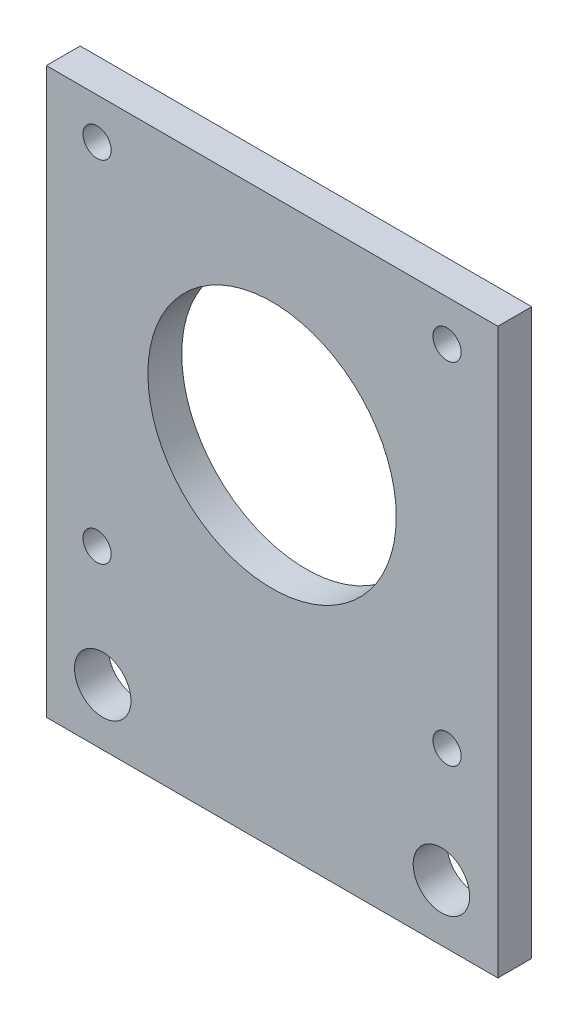
ISO-10303-21;
HEADER;
FILE_DESCRIPTION(('STEP AP214'),'2;1');
FILE_NAME('part.step','',(''),(''),'','','');
FILE_SCHEMA(('AUTOMOTIVE_DESIGN { 1 0 10303 214 1 1 1 1 }'));
ENDSEC;
DATA;
#1=APPLICATION_CONTEXT('core data for automotive mechanical design processes');
#2=APPLICATION_PROTOCOL_DEFINITION('international standard','automotive_design',2000,#1);
#3=PRODUCT_CONTEXT('',#1,'mechanical');
#4=PRODUCT('Part','Part','',(#3));
#5=PRODUCT_RELATED_PRODUCT_CATEGORY('part','',(#4));
#6=PRODUCT_DEFINITION_FORMATION('','',#4);
#7=PRODUCT_DEFINITION_CONTEXT('part definition',#1,'design');
#8=PRODUCT_DEFINITION('design','',#6,#7);
#9=PRODUCT_DEFINITION_SHAPE('','',#8);
#10=(LENGTH_UNIT() NAMED_UNIT(*) SI_UNIT(.MILLI.,.METRE.));
#11=(NAMED_UNIT(*) PLANE_ANGLE_UNIT() SI_UNIT($,.RADIAN.));
#12=(NAMED_UNIT(*) SI_UNIT($,.STERADIAN.) SOLID_ANGLE_UNIT());
#13=UNCERTAINTY_MEASURE_WITH_UNIT(LENGTH_MEASURE(1.E-05),#10,'distance_accuracy_value','');
#14=(GEOMETRIC_REPRESENTATION_CONTEXT(3) GLOBAL_UNCERTAINTY_ASSIGNED_CONTEXT((#13)) GLOBAL_UNIT_ASSIGNED_CONTEXT((#10,
#11,#12)) REPRESENTATION_CONTEXT('',''));
#15=CARTESIAN_POINT('',(0.,0.,0.));
#16=DIRECTION('',(0.,0.,1.));
#17=DIRECTION('',(1.,0.,0.));
#18=AXIS2_PLACEMENT_3D('',#15,#16,#17);
#19=CARTESIAN_POINT('',(0.,0.,3.));
#20=DIRECTION('',(0.,0.,1.));
#21=DIRECTION('',(1.,0.,0.));
#22=AXIS2_PLACEMENT_3D('',#19,#20,#21);
#23=PLANE('',#22);
#24=CARTESIAN_POINT('',(15.,-20.,3.));
#25=DIRECTION('',(0.,0.,1.));
#26=DIRECTION('',(-1.,0.,0.));
#27=AXIS2_PLACEMENT_3D('',#24,#25,#26);
#28=CIRCLE('',#27,2.5);
#29=CARTESIAN_POINT('',(12.5,-20.,3.));
#30=VERTEX_POINT('',#29);
#31=EDGE_CURVE('E140',#30,#30,#28,.T.);
#32=ORIENTED_EDGE('',*,*,#31,.F.);
#33=EDGE_LOOP('',(#32));
#34=FACE_BOUND('',#33,.T.);
#35=CARTESIAN_POINT('',(15.5,-9.62402367580224,3.));
#36=DIRECTION('',(0.,0.,1.));
#37=DIRECTION('',(1.,0.,0.));
#38=AXIS2_PLACEMENT_3D('',#35,#36,#37);
#39=CIRCLE('',#38,1.25);
#40=CARTESIAN_POINT('',(16.75,-9.62402367580224,3.));
#41=VERTEX_POINT('',#40);
#42=EDGE_CURVE('E128',#41,#41,#39,.T.);
#43=ORIENTED_EDGE('',*,*,#42,.F.);
#44=EDGE_LOOP('',(#43));
#45=FACE_BOUND('',#44,.T.);
#46=CARTESIAN_POINT('',(-15.5,-9.62402367580225,3.));
#47=DIRECTION('',(0.,0.,1.));
#48=DIRECTION('',(1.,0.,0.));
#49=AXIS2_PLACEMENT_3D('',#46,#47,#48);
#50=CIRCLE('',#49,1.25);
#51=CARTESIAN_POINT('',(-14.25,-9.62402367580225,3.));
#52=VERTEX_POINT('',#51);
#53=EDGE_CURVE('E116',#52,#52,#50,.T.);
#54=ORIENTED_EDGE('',*,*,#53,.F.);
#55=EDGE_LOOP('',(#54));
#56=FACE_BOUND('',#55,.T.);
#57=DIRECTION('',(0.,1.,0.));
#58=VECTOR('',#57,1.);
#59=CARTESIAN_POINT('',(20.,25.,3.));
#60=LINE('',#59,#58);
#61=CARTESIAN_POINT('',(20.,-25.,3.));
#62=VERTEX_POINT('',#61);
#63=CARTESIAN_POINT('',(20.,25.,3.));
#64=VERTEX_POINT('',#63);
#65=EDGE_CURVE('E86',#62,#64,#60,.T.);
#66=ORIENTED_EDGE('',*,*,#65,.T.);
#67=DIRECTION('',(-1.,0.,0.));
#68=VECTOR('',#67,1.);
#69=CARTESIAN_POINT('',(-20.,25.,3.));
#70=LINE('',#69,#68);
#71=CARTESIAN_POINT('',(-20.,25.,3.));
#72=VERTEX_POINT('',#71);
#73=EDGE_CURVE('E81',#64,#72,#70,.T.);
#74=ORIENTED_EDGE('',*,*,#73,.T.);
#75=DIRECTION('',(0.,-1.,0.));
#76=VECTOR('',#75,1.);
#77=CARTESIAN_POINT('',(-20.,25.,3.));
#78=LINE('',#77,#76);
#79=CARTESIAN_POINT('',(-20.,-25.,3.));
#80=VERTEX_POINT('',#79);
#81=EDGE_CURVE('E84',#72,#80,#78,.T.);
#82=ORIENTED_EDGE('',*,*,#81,.T.);
#83=DIRECTION('',(1.,0.,0.));
#84=VECTOR('',#83,1.);
#85=CARTESIAN_POINT('',(-20.,-25.,3.));
#86=LINE('',#85,#84);
#87=EDGE_CURVE('E51',#80,#62,#86,.T.);
#88=ORIENTED_EDGE('',*,*,#87,.T.);
#89=EDGE_LOOP('',(#66,#74,#82,#88));
#90=FACE_BOUND('',#89,.T.);
#91=CARTESIAN_POINT('',(-15.5,21.3759763241978,3.));
#92=DIRECTION('',(0.,0.,1.));
#93=DIRECTION('',(1.,0.,0.));
#94=AXIS2_PLACEMENT_3D('',#91,#92,#93);
#95=CIRCLE('',#94,1.25);
#96=CARTESIAN_POINT('',(-14.25,21.3759763241978,3.));
#97=VERTEX_POINT('',#96);
#98=EDGE_CURVE('E101',#97,#97,#95,.T.);
#99=ORIENTED_EDGE('',*,*,#98,.F.);
#100=EDGE_LOOP('',(#99));
#101=FACE_BOUND('',#100,.T.);
#102=CARTESIAN_POINT('',(15.5,21.3759763241978,3.));
#103=DIRECTION('',(0.,0.,1.));
#104=DIRECTION('',(1.,0.,0.));
#105=AXIS2_PLACEMENT_3D('',#102,#103,#104);
#106=CIRCLE('',#105,1.25);
#107=CARTESIAN_POINT('',(16.75,21.3759763241978,3.));
#108=VERTEX_POINT('',#107);
#109=EDGE_CURVE('E122',#108,#108,#106,.T.);
#110=ORIENTED_EDGE('',*,*,#109,.F.);
#111=EDGE_LOOP('',(#110));
#112=FACE_BOUND('',#111,.T.);
#113=CARTESIAN_POINT('',(-15.,-20.,3.));
#114=DIRECTION('',(0.,0.,1.));
#115=DIRECTION('',(1.,0.,0.));
#116=AXIS2_PLACEMENT_3D('',#113,#114,#115);
#117=CIRCLE('',#116,2.5);
#118=CARTESIAN_POINT('',(-12.5,-20.,3.));
#119=VERTEX_POINT('',#118);
#120=EDGE_CURVE('E134',#119,#119,#117,.T.);
#121=ORIENTED_EDGE('',*,*,#120,.F.);
#122=EDGE_LOOP('',(#121));
#123=FACE_BOUND('',#122,.T.);
#124=CARTESIAN_POINT('',(0.,5.87597632419776,3.));
#125=DIRECTION('',(0.,0.,1.));
#126=DIRECTION('',(1.,0.,0.));
#127=AXIS2_PLACEMENT_3D('',#124,#125,#126);
#128=CIRCLE('',#127,11.);
#129=CARTESIAN_POINT('',(11.,5.87597632419776,3.));
#130=VERTEX_POINT('',#129);
#131=EDGE_CURVE('E146',#130,#130,#128,.T.);
#132=ORIENTED_EDGE('',*,*,#131,.F.);
#133=EDGE_LOOP('',(#132));
#134=FACE_BOUND('',#133,.T.);
#135=ADVANCED_FACE('F34',(#34,#45,#56,#90,#101,#112,#123,#134),#23,.T.);
#136=CARTESIAN_POINT('',(0.,0.,0.));
#137=DIRECTION('',(0.,0.,1.));
#138=DIRECTION('',(1.,0.,0.));
#139=AXIS2_PLACEMENT_3D('',#136,#137,#138);
#140=PLANE('',#139);
#141=DIRECTION('',(0.,1.,0.));
#142=VECTOR('',#141,1.);
#143=CARTESIAN_POINT('',(20.,25.,0.));
#144=LINE('',#143,#142);
#145=CARTESIAN_POINT('',(20.,-25.,0.));
#146=VERTEX_POINT('',#145);
#147=CARTESIAN_POINT('',(20.,25.,0.));
#148=VERTEX_POINT('',#147);
#149=EDGE_CURVE('E98',#146,#148,#144,.T.);
#150=ORIENTED_EDGE('',*,*,#149,.F.);
#151=DIRECTION('',(1.,0.,0.));
#152=VECTOR('',#151,1.);
#153=CARTESIAN_POINT('',(-20.,-25.,0.));
#154=LINE('',#153,#152);
#155=CARTESIAN_POINT('',(-20.,-25.,0.));
#156=VERTEX_POINT('',#155);
#157=EDGE_CURVE('E74',#156,#146,#154,.T.);
#158=ORIENTED_EDGE('',*,*,#157,.F.);
#159=DIRECTION('',(0.,-1.,0.));
#160=VECTOR('',#159,1.);
#161=CARTESIAN_POINT('',(-20.,25.,0.));
#162=LINE('',#161,#160);
#163=CARTESIAN_POINT('',(-20.,25.,0.));
#164=VERTEX_POINT('',#163);
#165=EDGE_CURVE('E68',#164,#156,#162,.T.);
#166=ORIENTED_EDGE('',*,*,#165,.F.);
#167=DIRECTION('',(-1.,0.,0.));
#168=VECTOR('',#167,1.);
#169=CARTESIAN_POINT('',(-20.,25.,0.));
#170=LINE('',#169,#168);
#171=EDGE_CURVE('E90',#148,#164,#170,.T.);
#172=ORIENTED_EDGE('',*,*,#171,.F.);
#173=EDGE_LOOP('',(#150,#158,#166,#172));
#174=FACE_BOUND('',#173,.T.);
#175=CARTESIAN_POINT('',(-15.5,21.3759763241978,0.));
#176=DIRECTION('',(0.,0.,1.));
#177=DIRECTION('',(1.,0.,0.));
#178=AXIS2_PLACEMENT_3D('',#175,#176,#177);
#179=CIRCLE('',#178,1.25);
#180=CARTESIAN_POINT('',(-14.25,21.3759763241978,0.));
#181=VERTEX_POINT('',#180);
#182=EDGE_CURVE('E113',#181,#181,#179,.T.);
#183=ORIENTED_EDGE('',*,*,#182,.T.);
#184=EDGE_LOOP('',(#183));
#185=FACE_BOUND('',#184,.T.);
#186=CARTESIAN_POINT('',(-15.5,-9.62402367580225,0.));
#187=DIRECTION('',(0.,0.,1.));
#188=DIRECTION('',(1.,0.,0.));
#189=AXIS2_PLACEMENT_3D('',#186,#187,#188);
#190=CIRCLE('',#189,1.25);
#191=CARTESIAN_POINT('',(-14.25,-9.62402367580225,0.));
#192=VERTEX_POINT('',#191);
#193=EDGE_CURVE('E119',#192,#192,#190,.T.);
#194=ORIENTED_EDGE('',*,*,#193,.T.);
#195=EDGE_LOOP('',(#194));
#196=FACE_BOUND('',#195,.T.);
#197=CARTESIAN_POINT('',(15.5,21.3759763241978,0.));
#198=DIRECTION('',(0.,0.,1.));
#199=DIRECTION('',(1.,0.,0.));
#200=AXIS2_PLACEMENT_3D('',#197,#198,#199);
#201=CIRCLE('',#200,1.25);
#202=CARTESIAN_POINT('',(16.75,21.3759763241978,0.));
#203=VERTEX_POINT('',#202);
#204=EDGE_CURVE('E125',#203,#203,#201,.T.);
#205=ORIENTED_EDGE('',*,*,#204,.T.);
#206=EDGE_LOOP('',(#205));
#207=FACE_BOUND('',#206,.T.);
#208=CARTESIAN_POINT('',(15.5,-9.62402367580224,0.));
#209=DIRECTION('',(0.,0.,1.));
#210=DIRECTION('',(1.,0.,0.));
#211=AXIS2_PLACEMENT_3D('',#208,#209,#210);
#212=CIRCLE('',#211,1.25);
#213=CARTESIAN_POINT('',(16.75,-9.62402367580224,0.));
#214=VERTEX_POINT('',#213);
#215=EDGE_CURVE('E131',#214,#214,#212,.T.);
#216=ORIENTED_EDGE('',*,*,#215,.T.);
#217=EDGE_LOOP('',(#216));
#218=FACE_BOUND('',#217,.T.);
#219=CARTESIAN_POINT('',(-15.,-20.,0.));
#220=DIRECTION('',(0.,0.,1.));
#221=DIRECTION('',(1.,0.,0.));
#222=AXIS2_PLACEMENT_3D('',#219,#220,#221);
#223=CIRCLE('',#222,2.5);
#224=CARTESIAN_POINT('',(-12.5,-20.,0.));
#225=VERTEX_POINT('',#224);
#226=EDGE_CURVE('E137',#225,#225,#223,.T.);
#227=ORIENTED_EDGE('',*,*,#226,.T.);
#228=EDGE_LOOP('',(#227));
#229=FACE_BOUND('',#228,.T.);
#230=CARTESIAN_POINT('',(15.,-20.,0.));
#231=DIRECTION('',(0.,0.,1.));
#232=DIRECTION('',(-1.,0.,0.));
#233=AXIS2_PLACEMENT_3D('',#230,#231,#232);
#234=CIRCLE('',#233,2.5);
#235=CARTESIAN_POINT('',(12.5,-20.,0.));
#236=VERTEX_POINT('',#235);
#237=EDGE_CURVE('E143',#236,#236,#234,.T.);
#238=ORIENTED_EDGE('',*,*,#237,.T.);
#239=EDGE_LOOP('',(#238));
#240=FACE_BOUND('',#239,.T.);
#241=CARTESIAN_POINT('',(0.,5.87597632419776,0.));
#242=DIRECTION('',(0.,0.,1.));
#243=DIRECTION('',(1.,0.,0.));
#244=AXIS2_PLACEMENT_3D('',#241,#242,#243);
#245=CIRCLE('',#244,11.);
#246=CARTESIAN_POINT('',(11.,5.87597632419776,0.));
#247=VERTEX_POINT('',#246);
#248=EDGE_CURVE('E149',#247,#247,#245,.T.);
#249=ORIENTED_EDGE('',*,*,#248,.T.);
#250=EDGE_LOOP('',(#249));
#251=FACE_BOUND('',#250,.T.);
#252=ADVANCED_FACE('F109',(#174,#185,#196,#207,#218,#229,#240,#251),#140,.F.);
#253=CARTESIAN_POINT('',(20.,25.,3.));
#254=DIRECTION('',(-1.,0.,0.));
#255=DIRECTION('',(0.,-1.,0.));
#256=AXIS2_PLACEMENT_3D('',#253,#254,#255);
#257=PLANE('',#256);
#258=ORIENTED_EDGE('',*,*,#149,.T.);
#259=DIRECTION('',(0.,0.,-1.));
#260=VECTOR('',#259,1.);
#261=CARTESIAN_POINT('',(20.,25.,3.));
#262=LINE('',#261,#260);
#263=EDGE_CURVE('E11',#64,#148,#262,.T.);
#264=ORIENTED_EDGE('',*,*,#263,.F.);
#265=ORIENTED_EDGE('',*,*,#65,.F.);
#266=DIRECTION('',(0.,0.,-1.));
#267=VECTOR('',#266,1.);
#268=CARTESIAN_POINT('',(20.,-25.,3.));
#269=LINE('',#268,#267);
#270=EDGE_CURVE('E94',#62,#146,#269,.T.);
#271=ORIENTED_EDGE('',*,*,#270,.T.);
#272=EDGE_LOOP('',(#258,#264,#265,#271));
#273=FACE_BOUND('',#272,.T.);
#274=ADVANCED_FACE('F36',(#273),#257,.F.);
#275=CARTESIAN_POINT('',(-20.,25.,3.));
#276=DIRECTION('',(0.,-1.,0.));
#277=DIRECTION('',(0.,0.,-1.));
#278=AXIS2_PLACEMENT_3D('',#275,#276,#277);
#279=PLANE('',#278);
#280=ORIENTED_EDGE('',*,*,#171,.T.);
#281=DIRECTION('',(0.,0.,-1.));
#282=VECTOR('',#281,1.);
#283=CARTESIAN_POINT('',(-20.,25.,3.));
#284=LINE('',#283,#282);
#285=EDGE_CURVE('E43',#72,#164,#284,.T.);
#286=ORIENTED_EDGE('',*,*,#285,.F.);
#287=ORIENTED_EDGE('',*,*,#73,.F.);
#288=ORIENTED_EDGE('',*,*,#263,.T.);
#289=EDGE_LOOP('',(#280,#286,#287,#288));
#290=FACE_BOUND('',#289,.T.);
#291=ADVANCED_FACE('F89',(#290),#279,.F.);
#292=CARTESIAN_POINT('',(-20.,25.,3.));
#293=DIRECTION('',(1.,0.,0.));
#294=DIRECTION('',(0.,1.,0.));
#295=AXIS2_PLACEMENT_3D('',#292,#293,#294);
#296=PLANE('',#295);
#297=ORIENTED_EDGE('',*,*,#165,.T.);
#298=DIRECTION('',(0.,0.,-1.));
#299=VECTOR('',#298,1.);
#300=CARTESIAN_POINT('',(-20.,-25.,3.));
#301=LINE('',#300,#299);
#302=EDGE_CURVE('E91',#80,#156,#301,.T.);
#303=ORIENTED_EDGE('',*,*,#302,.F.);
#304=ORIENTED_EDGE('',*,*,#81,.F.);
#305=ORIENTED_EDGE('',*,*,#285,.T.);
#306=EDGE_LOOP('',(#297,#303,#304,#305));
#307=FACE_BOUND('',#306,.T.);
#308=ADVANCED_FACE('F92',(#307),#296,.F.);
#309=CARTESIAN_POINT('',(-20.,-25.,3.));
#310=DIRECTION('',(0.,1.,0.));
#311=DIRECTION('',(0.,0.,1.));
#312=AXIS2_PLACEMENT_3D('',#309,#310,#311);
#313=PLANE('',#312);
#314=ORIENTED_EDGE('',*,*,#157,.T.);
#315=ORIENTED_EDGE('',*,*,#270,.F.);
#316=ORIENTED_EDGE('',*,*,#87,.F.);
#317=ORIENTED_EDGE('',*,*,#302,.T.);
#318=EDGE_LOOP('',(#314,#315,#316,#317));
#319=FACE_BOUND('',#318,.T.);
#320=ADVANCED_FACE('F106',(#319),#313,.F.);
#321=CARTESIAN_POINT('',(-15.5,21.3759763241978,3.));
#322=DIRECTION('',(0.,0.,-1.));
#323=DIRECTION('',(-1.,0.,0.));
#324=AXIS2_PLACEMENT_3D('',#321,#322,#323);
#325=CYLINDRICAL_SURFACE('',#324,1.25);
#326=ORIENTED_EDGE('',*,*,#98,.T.);
#327=EDGE_LOOP('',(#326));
#328=FACE_BOUND('',#327,.T.);
#329=ORIENTED_EDGE('',*,*,#182,.F.);
#330=EDGE_LOOP('',(#329));
#331=FACE_BOUND('',#330,.T.);
#332=ADVANCED_FACE('F168',(#328,#331),#325,.F.);
#333=CARTESIAN_POINT('',(-15.5,-9.62402367580225,3.));
#334=DIRECTION('',(0.,0.,-1.));
#335=DIRECTION('',(-1.,0.,0.));
#336=AXIS2_PLACEMENT_3D('',#333,#334,#335);
#337=CYLINDRICAL_SURFACE('',#336,1.25);
#338=ORIENTED_EDGE('',*,*,#53,.T.);
#339=EDGE_LOOP('',(#338));
#340=FACE_BOUND('',#339,.T.);
#341=ORIENTED_EDGE('',*,*,#193,.F.);
#342=EDGE_LOOP('',(#341));
#343=FACE_BOUND('',#342,.T.);
#344=ADVANCED_FACE('F214',(#340,#343),#337,.F.);
#345=CARTESIAN_POINT('',(15.5,21.3759763241978,3.));
#346=DIRECTION('',(0.,0.,-1.));
#347=DIRECTION('',(-1.,0.,0.));
#348=AXIS2_PLACEMENT_3D('',#345,#346,#347);
#349=CYLINDRICAL_SURFACE('',#348,1.25);
#350=ORIENTED_EDGE('',*,*,#109,.T.);
#351=EDGE_LOOP('',(#350));
#352=FACE_BOUND('',#351,.T.);
#353=ORIENTED_EDGE('',*,*,#204,.F.);
#354=EDGE_LOOP('',(#353));
#355=FACE_BOUND('',#354,.T.);
#356=ADVANCED_FACE('F222',(#352,#355),#349,.F.);
#357=CARTESIAN_POINT('',(15.5,-9.62402367580224,3.));
#358=DIRECTION('',(0.,0.,-1.));
#359=DIRECTION('',(-1.,0.,0.));
#360=AXIS2_PLACEMENT_3D('',#357,#358,#359);
#361=CYLINDRICAL_SURFACE('',#360,1.25);
#362=ORIENTED_EDGE('',*,*,#42,.T.);
#363=EDGE_LOOP('',(#362));
#364=FACE_BOUND('',#363,.T.);
#365=ORIENTED_EDGE('',*,*,#215,.F.);
#366=EDGE_LOOP('',(#365));
#367=FACE_BOUND('',#366,.T.);
#368=ADVANCED_FACE('F230',(#364,#367),#361,.F.);
#369=CARTESIAN_POINT('',(-15.,-20.,3.));
#370=DIRECTION('',(0.,0.,-1.));
#371=DIRECTION('',(-1.,0.,0.));
#372=AXIS2_PLACEMENT_3D('',#369,#370,#371);
#373=CYLINDRICAL_SURFACE('',#372,2.5);
#374=ORIENTED_EDGE('',*,*,#120,.T.);
#375=EDGE_LOOP('',(#374));
#376=FACE_BOUND('',#375,.T.);
#377=ORIENTED_EDGE('',*,*,#226,.F.);
#378=EDGE_LOOP('',(#377));
#379=FACE_BOUND('',#378,.T.);
#380=ADVANCED_FACE('F239',(#376,#379),#373,.F.);
#381=CARTESIAN_POINT('',(15.,-20.,3.));
#382=DIRECTION('',(0.,0.,-1.));
#383=DIRECTION('',(-1.,0.,0.));
#384=AXIS2_PLACEMENT_3D('',#381,#382,#383);
#385=CYLINDRICAL_SURFACE('',#384,2.5);
#386=ORIENTED_EDGE('',*,*,#31,.T.);
#387=EDGE_LOOP('',(#386));
#388=FACE_BOUND('',#387,.T.);
#389=ORIENTED_EDGE('',*,*,#237,.F.);
#390=EDGE_LOOP('',(#389));
#391=FACE_BOUND('',#390,.T.);
#392=ADVANCED_FACE('F248',(#388,#391),#385,.F.);
#393=CARTESIAN_POINT('',(0.,5.87597632419776,3.));
#394=DIRECTION('',(0.,0.,-1.));
#395=DIRECTION('',(-1.,0.,0.));
#396=AXIS2_PLACEMENT_3D('',#393,#394,#395);
#397=CYLINDRICAL_SURFACE('',#396,11.);
#398=ORIENTED_EDGE('',*,*,#131,.T.);
#399=EDGE_LOOP('',(#398));
#400=FACE_BOUND('',#399,.T.);
#401=ORIENTED_EDGE('',*,*,#248,.F.);
#402=EDGE_LOOP('',(#401));
#403=FACE_BOUND('',#402,.T.);
#404=ADVANCED_FACE('F155',(#400,#403),#397,.F.);
#405=CLOSED_SHELL('',(#135,#252,#274,#291,#308,#320,#332,#344,#356,#368,#380,#392,#404));
#406=MANIFOLD_SOLID_BREP('B2',#405);
#407=ADVANCED_BREP_SHAPE_REPRESENTATION('',(#18,#406),#14);
#408=SHAPE_DEFINITION_REPRESENTATION(#9,#407);
ENDSEC;
END-ISO-10303-21;
